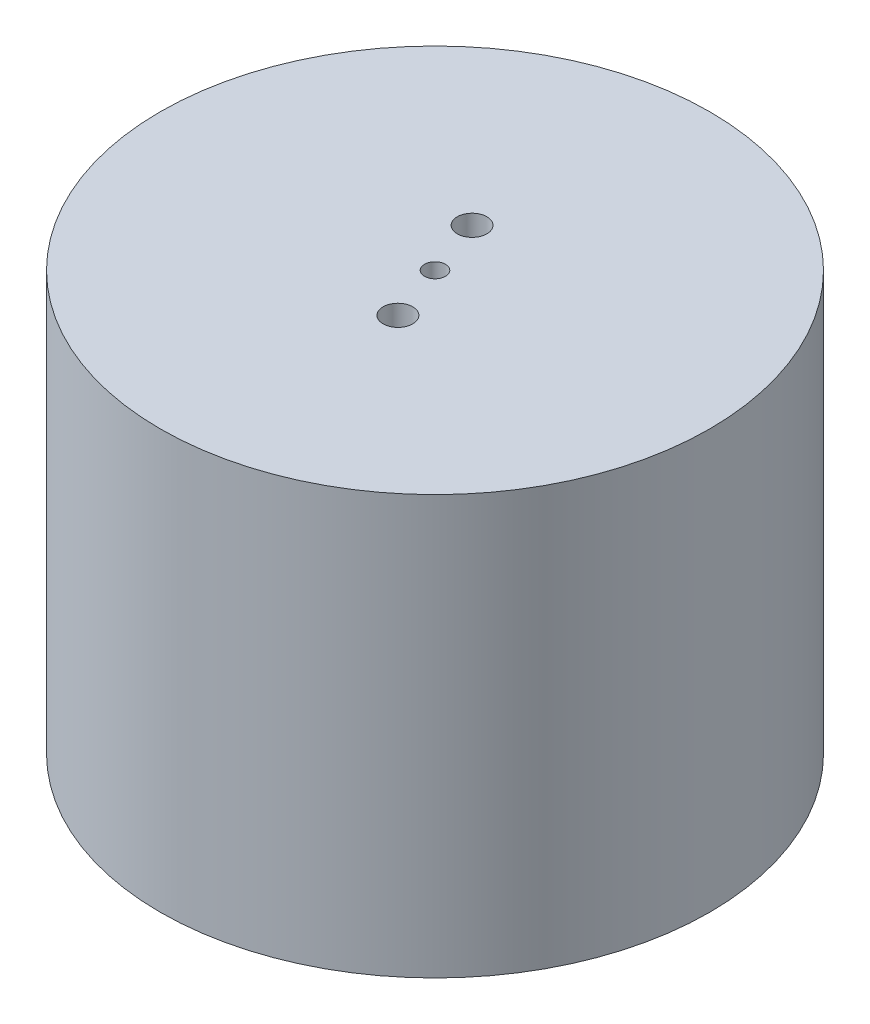
ISO-10303-21;
HEADER;
FILE_DESCRIPTION(('STEP AP214'),'2;1');
FILE_NAME('part.step','',(''),(''),'','','');
FILE_SCHEMA(('AUTOMOTIVE_DESIGN { 1 0 10303 214 1 1 1 1 }'));
ENDSEC;
DATA;
#1=APPLICATION_CONTEXT('core data for automotive mechanical design processes');
#2=APPLICATION_PROTOCOL_DEFINITION('international standard','automotive_design',2000,#1);
#3=PRODUCT_CONTEXT('',#1,'mechanical');
#4=PRODUCT('Part','Part','',(#3));
#5=PRODUCT_RELATED_PRODUCT_CATEGORY('part','',(#4));
#6=PRODUCT_DEFINITION_FORMATION('','',#4);
#7=PRODUCT_DEFINITION_CONTEXT('part definition',#1,'design');
#8=PRODUCT_DEFINITION('design','',#6,#7);
#9=PRODUCT_DEFINITION_SHAPE('','',#8);
#10=(LENGTH_UNIT() NAMED_UNIT(*) SI_UNIT(.MILLI.,.METRE.));
#11=(NAMED_UNIT(*) PLANE_ANGLE_UNIT() SI_UNIT($,.RADIAN.));
#12=(NAMED_UNIT(*) SI_UNIT($,.STERADIAN.) SOLID_ANGLE_UNIT());
#13=UNCERTAINTY_MEASURE_WITH_UNIT(LENGTH_MEASURE(1.E-05),#10,'distance_accuracy_value','');
#14=(GEOMETRIC_REPRESENTATION_CONTEXT(3) GLOBAL_UNCERTAINTY_ASSIGNED_CONTEXT((#13)) GLOBAL_UNIT_ASSIGNED_CONTEXT((#10,
#11,#12)) REPRESENTATION_CONTEXT('',''));
#15=CARTESIAN_POINT('',(0.,0.,0.));
#16=DIRECTION('',(0.,0.,1.));
#17=DIRECTION('',(1.,0.,0.));
#18=AXIS2_PLACEMENT_3D('',#15,#16,#17);
#19=CARTESIAN_POINT('',(0.,0.,0.));
#20=DIRECTION('',(0.,1.,0.));
#21=DIRECTION('',(0.,0.,1.));
#22=AXIS2_PLACEMENT_3D('',#19,#20,#21);
#23=PLANE('',#22);
#24=CARTESIAN_POINT('',(0.,0.,0.));
#25=DIRECTION('',(0.,1.,0.));
#26=DIRECTION('',(0.,0.,1.));
#27=AXIS2_PLACEMENT_3D('',#24,#25,#26);
#28=CIRCLE('',#27,31.5);
#29=CARTESIAN_POINT('',(0.,0.,31.5));
#30=VERTEX_POINT('',#29);
#31=EDGE_CURVE('E39',#30,#30,#28,.T.);
#32=ORIENTED_EDGE('',*,*,#31,.F.);
#33=EDGE_LOOP('',(#32));
#34=FACE_BOUND('',#33,.T.);
#35=CARTESIAN_POINT('',(0.,0.,0.));
#36=DIRECTION('',(0.,1.,0.));
#37=DIRECTION('',(0.,0.,1.));
#38=AXIS2_PLACEMENT_3D('',#35,#36,#37);
#39=CIRCLE('',#38,26.5);
#40=CARTESIAN_POINT('',(0.,0.,26.5));
#41=VERTEX_POINT('',#40);
#42=EDGE_CURVE('E47',#41,#41,#39,.T.);
#43=ORIENTED_EDGE('',*,*,#42,.T.);
#44=EDGE_LOOP('',(#43));
#45=FACE_BOUND('',#44,.T.);
#46=ADVANCED_FACE('F31',(#34,#45),#23,.F.);
#47=CARTESIAN_POINT('',(0.,48.,0.));
#48=DIRECTION('',(0.,-1.,0.));
#49=DIRECTION('',(0.,0.,-1.));
#50=AXIS2_PLACEMENT_3D('',#47,#48,#49);
#51=CYLINDRICAL_SURFACE('',#50,31.5);
#52=CARTESIAN_POINT('',(0.,48.,0.));
#53=DIRECTION('',(0.,1.,0.));
#54=DIRECTION('',(0.,0.,1.));
#55=AXIS2_PLACEMENT_3D('',#52,#53,#54);
#56=CIRCLE('',#55,31.5);
#57=CARTESIAN_POINT('',(0.,48.,31.5));
#58=VERTEX_POINT('',#57);
#59=EDGE_CURVE('E10',#58,#58,#56,.T.);
#60=ORIENTED_EDGE('',*,*,#59,.F.);
#61=EDGE_LOOP('',(#60));
#62=FACE_BOUND('',#61,.T.);
#63=ORIENTED_EDGE('',*,*,#31,.T.);
#64=EDGE_LOOP('',(#63));
#65=FACE_BOUND('',#64,.T.);
#66=ADVANCED_FACE('F33',(#62,#65),#51,.T.);
#67=CARTESIAN_POINT('',(0.,48.,0.));
#68=DIRECTION('',(0.,1.,0.));
#69=DIRECTION('',(0.,0.,1.));
#70=AXIS2_PLACEMENT_3D('',#67,#68,#69);
#71=PLANE('',#70);
#72=CARTESIAN_POINT('',(0.,48.,0.));
#73=DIRECTION('',(0.,1.,0.));
#74=DIRECTION('',(0.,0.,1.));
#75=AXIS2_PLACEMENT_3D('',#72,#73,#74);
#76=CIRCLE('',#75,1.2);
#77=CARTESIAN_POINT('',(0.,48.,1.2));
#78=VERTEX_POINT('',#77);
#79=EDGE_CURVE('E101',#78,#78,#76,.T.);
#80=ORIENTED_EDGE('',*,*,#79,.F.);
#81=EDGE_LOOP('',(#80));
#82=FACE_BOUND('',#81,.T.);
#83=CARTESIAN_POINT('',(-2.34504704508036,48.,-6.59551016649659));
#84=DIRECTION('',(0.,1.,0.));
#85=DIRECTION('',(0.,0.,1.));
#86=AXIS2_PLACEMENT_3D('',#83,#84,#85);
#87=CIRCLE('',#86,1.69999999999999);
#88=CARTESIAN_POINT('',(-2.34504704508036,48.,-4.8955101664966));
#89=VERTEX_POINT('',#88);
#90=EDGE_CURVE('E61',#89,#89,#87,.T.);
#91=ORIENTED_EDGE('',*,*,#90,.F.);
#92=EDGE_LOOP('',(#91));
#93=FACE_BOUND('',#92,.T.);
#94=CARTESIAN_POINT('',(2.34504704508041,48.,6.59551016649657));
#95=DIRECTION('',(0.,1.,0.));
#96=DIRECTION('',(0.,0.,1.));
#97=AXIS2_PLACEMENT_3D('',#94,#95,#96);
#98=CIRCLE('',#97,1.69999999999999);
#99=CARTESIAN_POINT('',(2.34504704508041,48.,8.29551016649656));
#100=VERTEX_POINT('',#99);
#101=EDGE_CURVE('E51',#100,#100,#98,.T.);
#102=ORIENTED_EDGE('',*,*,#101,.F.);
#103=EDGE_LOOP('',(#102));
#104=FACE_BOUND('',#103,.T.);
#105=ORIENTED_EDGE('',*,*,#59,.T.);
#106=EDGE_LOOP('',(#105));
#107=FACE_BOUND('',#106,.T.);
#108=ADVANCED_FACE('F81',(#82,#93,#104,#107),#71,.T.);
#109=CARTESIAN_POINT('',(0.,43.,0.));
#110=DIRECTION('',(0.,-1.,0.));
#111=DIRECTION('',(0.,0.,-1.));
#112=AXIS2_PLACEMENT_3D('',#109,#110,#111);
#113=CYLINDRICAL_SURFACE('',#112,26.5);
#114=CARTESIAN_POINT('',(0.,43.,0.));
#115=DIRECTION('',(0.,1.,0.));
#116=DIRECTION('',(0.,0.,1.));
#117=AXIS2_PLACEMENT_3D('',#114,#115,#116);
#118=CIRCLE('',#117,26.5);
#119=CARTESIAN_POINT('',(0.,43.,26.5));
#120=VERTEX_POINT('',#119);
#121=EDGE_CURVE('E44',#120,#120,#118,.T.);
#122=ORIENTED_EDGE('',*,*,#121,.T.);
#123=EDGE_LOOP('',(#122));
#124=FACE_BOUND('',#123,.T.);
#125=ORIENTED_EDGE('',*,*,#42,.F.);
#126=EDGE_LOOP('',(#125));
#127=FACE_BOUND('',#126,.T.);
#128=ADVANCED_FACE('F67',(#124,#127),#113,.F.);
#129=CARTESIAN_POINT('',(0.,43.,0.));
#130=DIRECTION('',(0.,1.,0.));
#131=DIRECTION('',(0.,0.,1.));
#132=AXIS2_PLACEMENT_3D('',#129,#130,#131);
#133=PLANE('',#132);
#134=CARTESIAN_POINT('',(0.,43.,0.));
#135=DIRECTION('',(0.,1.,0.));
#136=DIRECTION('',(0.,0.,1.));
#137=AXIS2_PLACEMENT_3D('',#134,#135,#136);
#138=CIRCLE('',#137,1.2);
#139=CARTESIAN_POINT('',(0.,43.,1.2));
#140=VERTEX_POINT('',#139);
#141=EDGE_CURVE('E35',#140,#140,#138,.T.);
#142=ORIENTED_EDGE('',*,*,#141,.T.);
#143=EDGE_LOOP('',(#142));
#144=FACE_BOUND('',#143,.T.);
#145=CARTESIAN_POINT('',(-2.34504704508036,43.,-6.59551016649659));
#146=DIRECTION('',(0.,1.,0.));
#147=DIRECTION('',(0.,0.,1.));
#148=AXIS2_PLACEMENT_3D('',#145,#146,#147);
#149=CIRCLE('',#148,1.69999999999999);
#150=CARTESIAN_POINT('',(-2.34504704508036,43.,-4.8955101664966));
#151=VERTEX_POINT('',#150);
#152=EDGE_CURVE('E56',#151,#151,#149,.T.);
#153=ORIENTED_EDGE('',*,*,#152,.T.);
#154=EDGE_LOOP('',(#153));
#155=FACE_BOUND('',#154,.T.);
#156=CARTESIAN_POINT('',(2.34504704508041,43.,6.59551016649657));
#157=DIRECTION('',(0.,1.,0.));
#158=DIRECTION('',(0.,0.,1.));
#159=AXIS2_PLACEMENT_3D('',#156,#157,#158);
#160=CIRCLE('',#159,1.69999999999999);
#161=CARTESIAN_POINT('',(2.34504704508041,43.,8.29551016649656));
#162=VERTEX_POINT('',#161);
#163=EDGE_CURVE('E49',#162,#162,#160,.T.);
#164=ORIENTED_EDGE('',*,*,#163,.T.);
#165=EDGE_LOOP('',(#164));
#166=FACE_BOUND('',#165,.T.);
#167=ORIENTED_EDGE('',*,*,#121,.F.);
#168=EDGE_LOOP('',(#167));
#169=FACE_BOUND('',#168,.T.);
#170=ADVANCED_FACE('F70',(#144,#155,#166,#169),#133,.F.);
#171=CARTESIAN_POINT('',(2.34504704508041,48.,6.59551016649657));
#172=DIRECTION('',(0.,1.,0.));
#173=DIRECTION('',(0.,0.,1.));
#174=AXIS2_PLACEMENT_3D('',#171,#172,#173);
#175=CYLINDRICAL_SURFACE('',#174,1.69999999999999);
#176=ORIENTED_EDGE('',*,*,#101,.T.);
#177=EDGE_LOOP('',(#176));
#178=FACE_BOUND('',#177,.T.);
#179=ORIENTED_EDGE('',*,*,#163,.F.);
#180=EDGE_LOOP('',(#179));
#181=FACE_BOUND('',#180,.T.);
#182=ADVANCED_FACE('F72',(#178,#181),#175,.F.);
#183=CARTESIAN_POINT('',(-2.34504704508036,48.,-6.59551016649659));
#184=DIRECTION('',(0.,1.,0.));
#185=DIRECTION('',(0.,0.,1.));
#186=AXIS2_PLACEMENT_3D('',#183,#184,#185);
#187=CYLINDRICAL_SURFACE('',#186,1.69999999999999);
#188=ORIENTED_EDGE('',*,*,#90,.T.);
#189=EDGE_LOOP('',(#188));
#190=FACE_BOUND('',#189,.T.);
#191=ORIENTED_EDGE('',*,*,#152,.F.);
#192=EDGE_LOOP('',(#191));
#193=FACE_BOUND('',#192,.T.);
#194=ADVANCED_FACE('F79',(#190,#193),#187,.F.);
#195=CARTESIAN_POINT('',(0.,38.,0.));
#196=DIRECTION('',(0.,1.,0.));
#197=DIRECTION('',(0.,0.,1.));
#198=AXIS2_PLACEMENT_3D('',#195,#196,#197);
#199=CYLINDRICAL_SURFACE('',#198,1.2);
#200=ORIENTED_EDGE('',*,*,#79,.T.);
#201=EDGE_LOOP('',(#200));
#202=FACE_BOUND('',#201,.T.);
#203=ORIENTED_EDGE('',*,*,#141,.F.);
#204=EDGE_LOOP('',(#203));
#205=FACE_BOUND('',#204,.T.);
#206=ADVANCED_FACE('F108',(#202,#205),#199,.F.);
#207=CLOSED_SHELL('',(#46,#66,#108,#128,#170,#182,#194,#206));
#208=MANIFOLD_SOLID_BREP('B2',#207);
#209=ADVANCED_BREP_SHAPE_REPRESENTATION('',(#18,#208),#14);
#210=SHAPE_DEFINITION_REPRESENTATION(#9,#209);
ENDSEC;
END-ISO-10303-21;
